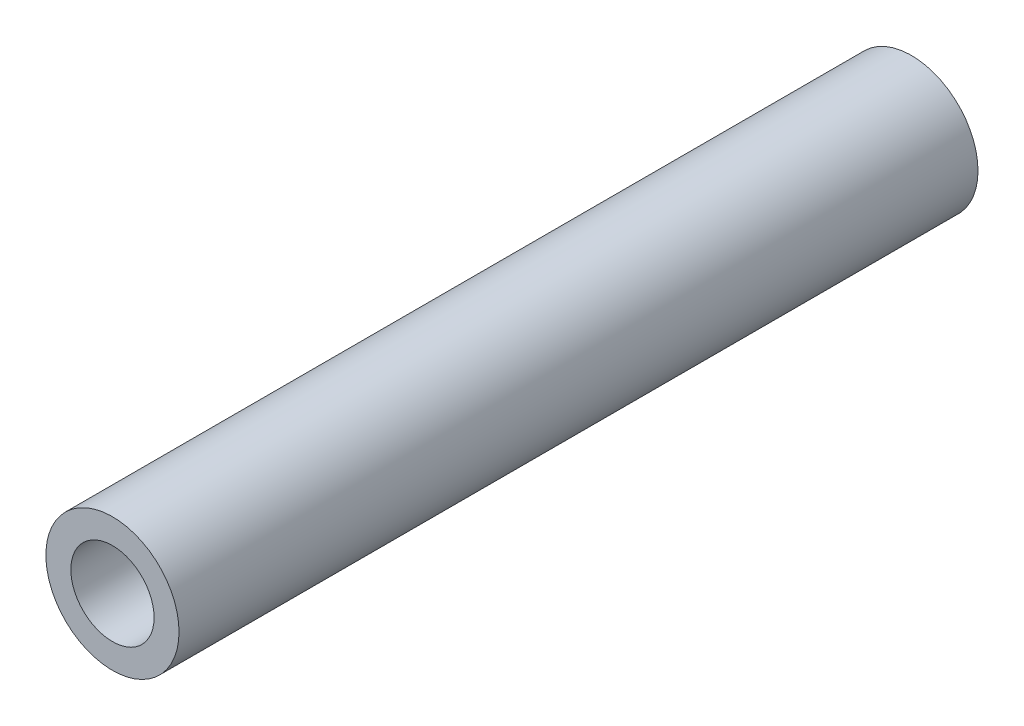
ISO-10303-21;
HEADER;
FILE_DESCRIPTION(('STEP AP214'),'2;1');
FILE_NAME('part.step','',(''),(''),'','','');
FILE_SCHEMA(('AUTOMOTIVE_DESIGN { 1 0 10303 214 1 1 1 1 }'));
ENDSEC;
DATA;
#1=APPLICATION_CONTEXT('core data for automotive mechanical design processes');
#2=APPLICATION_PROTOCOL_DEFINITION('international standard','automotive_design',2000,#1);
#3=PRODUCT_CONTEXT('',#1,'mechanical');
#4=PRODUCT('Part','Part','',(#3));
#5=PRODUCT_RELATED_PRODUCT_CATEGORY('part','',(#4));
#6=PRODUCT_DEFINITION_FORMATION('','',#4);
#7=PRODUCT_DEFINITION_CONTEXT('part definition',#1,'design');
#8=PRODUCT_DEFINITION('design','',#6,#7);
#9=PRODUCT_DEFINITION_SHAPE('','',#8);
#10=(LENGTH_UNIT() NAMED_UNIT(*) SI_UNIT(.MILLI.,.METRE.));
#11=(NAMED_UNIT(*) PLANE_ANGLE_UNIT() SI_UNIT($,.RADIAN.));
#12=(NAMED_UNIT(*) SI_UNIT($,.STERADIAN.) SOLID_ANGLE_UNIT());
#13=UNCERTAINTY_MEASURE_WITH_UNIT(LENGTH_MEASURE(1.E-05),#10,'distance_accuracy_value','');
#14=(GEOMETRIC_REPRESENTATION_CONTEXT(3) GLOBAL_UNCERTAINTY_ASSIGNED_CONTEXT((#13)) GLOBAL_UNIT_ASSIGNED_CONTEXT((#10,
#11,#12)) REPRESENTATION_CONTEXT('',''));
#15=CARTESIAN_POINT('',(0.,0.,0.));
#16=DIRECTION('',(0.,0.,1.));
#17=DIRECTION('',(1.,0.,0.));
#18=AXIS2_PLACEMENT_3D('',#15,#16,#17);
#19=CARTESIAN_POINT('',(0.,0.,48.));
#20=DIRECTION('',(0.,0.,1.));
#21=DIRECTION('',(1.,0.,0.));
#22=AXIS2_PLACEMENT_3D('',#19,#20,#21);
#23=PLANE('',#22);
#24=CARTESIAN_POINT('',(0.,0.,48.));
#25=DIRECTION('',(0.,0.,1.));
#26=DIRECTION('',(1.,0.,0.));
#27=AXIS2_PLACEMENT_3D('',#24,#25,#26);
#28=CIRCLE('',#27,4.);
#29=CARTESIAN_POINT('',(4.,0.,48.));
#30=VERTEX_POINT('',#29);
#31=EDGE_CURVE('E10',#30,#30,#28,.T.);
#32=ORIENTED_EDGE('',*,*,#31,.T.);
#33=EDGE_LOOP('',(#32));
#34=FACE_BOUND('',#33,.T.);
#35=CARTESIAN_POINT('',(0.,0.,48.));
#36=DIRECTION('',(0.,0.,1.));
#37=DIRECTION('',(1.,0.,0.));
#38=AXIS2_PLACEMENT_3D('',#35,#36,#37);
#39=CIRCLE('',#38,2.5);
#40=CARTESIAN_POINT('',(2.5,0.,48.));
#41=VERTEX_POINT('',#40);
#42=EDGE_CURVE('E50',#41,#41,#39,.T.);
#43=ORIENTED_EDGE('',*,*,#42,.F.);
#44=EDGE_LOOP('',(#43));
#45=FACE_BOUND('',#44,.T.);
#46=ADVANCED_FACE('F37',(#34,#45),#23,.T.);
#47=CARTESIAN_POINT('',(0.,0.,0.));
#48=DIRECTION('',(0.,0.,1.));
#49=DIRECTION('',(1.,0.,0.));
#50=AXIS2_PLACEMENT_3D('',#47,#48,#49);
#51=PLANE('',#50);
#52=CARTESIAN_POINT('',(0.,0.,0.));
#53=DIRECTION('',(0.,0.,1.));
#54=DIRECTION('',(1.,0.,0.));
#55=AXIS2_PLACEMENT_3D('',#52,#53,#54);
#56=CIRCLE('',#55,4.);
#57=CARTESIAN_POINT('',(4.,0.,0.));
#58=VERTEX_POINT('',#57);
#59=EDGE_CURVE('E41',#58,#58,#56,.T.);
#60=ORIENTED_EDGE('',*,*,#59,.F.);
#61=EDGE_LOOP('',(#60));
#62=FACE_BOUND('',#61,.T.);
#63=CARTESIAN_POINT('',(0.,0.,0.));
#64=DIRECTION('',(0.,0.,1.));
#65=DIRECTION('',(1.,0.,0.));
#66=AXIS2_PLACEMENT_3D('',#63,#64,#65);
#67=CIRCLE('',#66,2.5);
#68=CARTESIAN_POINT('',(2.5,0.,0.));
#69=VERTEX_POINT('',#68);
#70=EDGE_CURVE('E52',#69,#69,#67,.T.);
#71=ORIENTED_EDGE('',*,*,#70,.T.);
#72=EDGE_LOOP('',(#71));
#73=FACE_BOUND('',#72,.T.);
#74=ADVANCED_FACE('F64',(#62,#73),#51,.F.);
#75=CARTESIAN_POINT('',(0.,0.,48.));
#76=DIRECTION('',(0.,0.,-1.));
#77=DIRECTION('',(-1.,0.,0.));
#78=AXIS2_PLACEMENT_3D('',#75,#76,#77);
#79=CYLINDRICAL_SURFACE('',#78,4.);
#80=ORIENTED_EDGE('',*,*,#31,.F.);
#81=EDGE_LOOP('',(#80));
#82=FACE_BOUND('',#81,.T.);
#83=ORIENTED_EDGE('',*,*,#59,.T.);
#84=EDGE_LOOP('',(#83));
#85=FACE_BOUND('',#84,.T.);
#86=ADVANCED_FACE('F39',(#82,#85),#79,.T.);
#87=CARTESIAN_POINT('',(0.,0.,48.));
#88=DIRECTION('',(0.,0.,-1.));
#89=DIRECTION('',(-1.,0.,0.));
#90=AXIS2_PLACEMENT_3D('',#87,#88,#89);
#91=CYLINDRICAL_SURFACE('',#90,2.5);
#92=ORIENTED_EDGE('',*,*,#42,.T.);
#93=EDGE_LOOP('',(#92));
#94=FACE_BOUND('',#93,.T.);
#95=ORIENTED_EDGE('',*,*,#70,.F.);
#96=EDGE_LOOP('',(#95));
#97=FACE_BOUND('',#96,.T.);
#98=ADVANCED_FACE('F60',(#94,#97),#91,.F.);
#99=CLOSED_SHELL('',(#46,#74,#86,#98));
#100=MANIFOLD_SOLID_BREP('B2',#99);
#101=ADVANCED_BREP_SHAPE_REPRESENTATION('',(#18,#100),#14);
#102=SHAPE_DEFINITION_REPRESENTATION(#9,#101);
ENDSEC;
END-ISO-10303-21;
